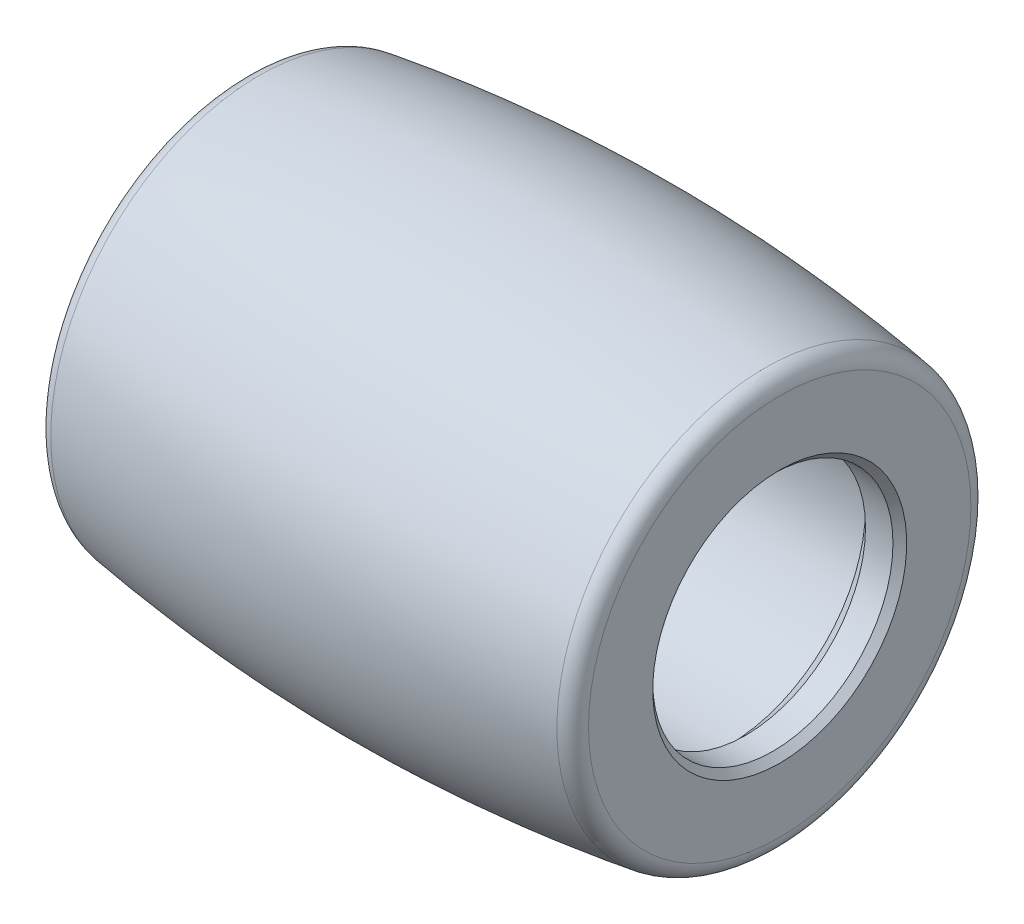
ISO-10303-21;
HEADER;
FILE_DESCRIPTION(('STEP AP214'),'2;1');
FILE_NAME('part.step','',(''),(''),'','','');
FILE_SCHEMA(('AUTOMOTIVE_DESIGN { 1 0 10303 214 1 1 1 1 }'));
ENDSEC;
DATA;
#1=APPLICATION_CONTEXT('core data for automotive mechanical design processes');
#2=APPLICATION_PROTOCOL_DEFINITION('international standard','automotive_design',2000,#1);
#3=PRODUCT_CONTEXT('',#1,'mechanical');
#4=PRODUCT('Part','Part','',(#3));
#5=PRODUCT_RELATED_PRODUCT_CATEGORY('part','',(#4));
#6=PRODUCT_DEFINITION_FORMATION('','',#4);
#7=PRODUCT_DEFINITION_CONTEXT('part definition',#1,'design');
#8=PRODUCT_DEFINITION('design','',#6,#7);
#9=PRODUCT_DEFINITION_SHAPE('','',#8);
#10=(LENGTH_UNIT() NAMED_UNIT(*) SI_UNIT(.MILLI.,.METRE.));
#11=(NAMED_UNIT(*) PLANE_ANGLE_UNIT() SI_UNIT($,.RADIAN.));
#12=(NAMED_UNIT(*) SI_UNIT($,.STERADIAN.) SOLID_ANGLE_UNIT());
#13=UNCERTAINTY_MEASURE_WITH_UNIT(LENGTH_MEASURE(1.E-05),#10,'distance_accuracy_value','');
#14=(GEOMETRIC_REPRESENTATION_CONTEXT(3) GLOBAL_UNCERTAINTY_ASSIGNED_CONTEXT((#13)) GLOBAL_UNIT_ASSIGNED_CONTEXT((#10,
#11,#12)) REPRESENTATION_CONTEXT('',''));
#15=CARTESIAN_POINT('',(0.,0.,0.));
#16=DIRECTION('',(0.,0.,1.));
#17=DIRECTION('',(1.,0.,0.));
#18=AXIS2_PLACEMENT_3D('',#15,#16,#17);
#19=CARTESIAN_POINT('',(-7.8,0.,0.));
#20=DIRECTION('',(-1.,0.,0.));
#21=DIRECTION('',(0.,0.,1.));
#22=AXIS2_PLACEMENT_3D('',#19,#20,#21);
#23=CYLINDRICAL_SURFACE('',#22,4.);
#24=CARTESIAN_POINT('',(-6.30000000012387,0.,0.));
#25=DIRECTION('',(1.,0.,0.));
#26=DIRECTION('',(0.,0.,-1.));
#27=AXIS2_PLACEMENT_3D('',#24,#25,#26);
#28=CIRCLE('',#27,3.99999999996226);
#29=CARTESIAN_POINT('',(-6.30000000012387,0.,-3.99999999996226));
#30=VERTEX_POINT('',#29);
#31=EDGE_CURVE('E55',#30,#30,#28,.F.);
#32=ORIENTED_EDGE('',*,*,#31,.T.);
#33=EDGE_LOOP('',(#32));
#34=FACE_BOUND('',#33,.T.);
#35=CARTESIAN_POINT('',(6.30000000012387,0.,0.));
#36=DIRECTION('',(-1.,0.,0.));
#37=DIRECTION('',(0.,0.,1.));
#38=AXIS2_PLACEMENT_3D('',#35,#36,#37);
#39=CIRCLE('',#38,3.99999999996226);
#40=CARTESIAN_POINT('',(6.30000000012387,0.,3.99999999996226));
#41=VERTEX_POINT('',#40);
#42=EDGE_CURVE('E78',#41,#41,#39,.F.);
#43=ORIENTED_EDGE('',*,*,#42,.T.);
#44=EDGE_LOOP('',(#43));
#45=FACE_BOUND('',#44,.T.);
#46=ADVANCED_FACE('F24',(#34,#45),#23,.F.);
#47=CARTESIAN_POINT('',(-6.30000000023756,0.,0.));
#48=DIRECTION('',(1.,0.,0.));
#49=DIRECTION('',(0.,0.,-1.));
#50=AXIS2_PLACEMENT_3D('',#47,#48,#49);
#51=CONICAL_SURFACE('',#50,3.99999999984857,0.785398163397448);
#52=CARTESIAN_POINT('',(-6.8,0.,0.));
#53=DIRECTION('',(1.,0.,0.));
#54=DIRECTION('',(0.,0.,-1.));
#55=AXIS2_PLACEMENT_3D('',#52,#53,#54);
#56=CIRCLE('',#55,3.5);
#57=CARTESIAN_POINT('',(-6.8,0.,-3.5));
#58=VERTEX_POINT('',#57);
#59=EDGE_CURVE('E76',#58,#58,#56,.F.);
#60=ORIENTED_EDGE('',*,*,#59,.T.);
#61=EDGE_LOOP('',(#60));
#62=FACE_BOUND('',#61,.T.);
#63=ORIENTED_EDGE('',*,*,#31,.F.);
#64=EDGE_LOOP('',(#63));
#65=FACE_BOUND('',#64,.T.);
#66=ADVANCED_FACE('F86',(#62,#65),#51,.F.);
#67=CARTESIAN_POINT('',(6.30000000023756,0.,0.));
#68=DIRECTION('',(-1.,0.,0.));
#69=DIRECTION('',(0.,0.,1.));
#70=AXIS2_PLACEMENT_3D('',#67,#68,#69);
#71=CONICAL_SURFACE('',#70,3.99999999984857,0.785398163397448);
#72=ORIENTED_EDGE('',*,*,#42,.F.);
#73=EDGE_LOOP('',(#72));
#74=FACE_BOUND('',#73,.T.);
#75=CARTESIAN_POINT('',(6.8,0.,0.));
#76=DIRECTION('',(1.,0.,0.));
#77=DIRECTION('',(0.,0.,-1.));
#78=AXIS2_PLACEMENT_3D('',#75,#76,#77);
#79=CIRCLE('',#78,3.5);
#80=CARTESIAN_POINT('',(6.8,0.,-3.5));
#81=VERTEX_POINT('',#80);
#82=EDGE_CURVE('E69',#81,#81,#79,.T.);
#83=ORIENTED_EDGE('',*,*,#82,.T.);
#84=EDGE_LOOP('',(#83));
#85=FACE_BOUND('',#84,.T.);
#86=ADVANCED_FACE('F88',(#74,#85),#71,.F.);
#87=CARTESIAN_POINT('',(-7.8,0.,0.));
#88=DIRECTION('',(1.,0.,0.));
#89=DIRECTION('',(0.,0.,-1.));
#90=AXIS2_PLACEMENT_3D('',#87,#88,#89);
#91=CYLINDRICAL_SURFACE('',#90,3.5);
#92=CARTESIAN_POINT('',(-7.60000000002492,0.,0.));
#93=DIRECTION('',(-1.,0.,0.));
#94=DIRECTION('',(0.,-1.,0.));
#95=AXIS2_PLACEMENT_3D('',#92,#93,#94);
#96=CIRCLE('',#95,3.49999999997408);
#97=CARTESIAN_POINT('',(-7.60000000002492,-3.49999999997408,0.));
#98=VERTEX_POINT('',#97);
#99=EDGE_CURVE('E64',#98,#98,#96,.T.);
#100=ORIENTED_EDGE('',*,*,#99,.T.);
#101=EDGE_LOOP('',(#100));
#102=FACE_BOUND('',#101,.T.);
#103=ORIENTED_EDGE('',*,*,#59,.F.);
#104=EDGE_LOOP('',(#103));
#105=FACE_BOUND('',#104,.T.);
#106=ADVANCED_FACE('F96',(#102,#105),#91,.F.);
#107=CARTESIAN_POINT('',(7.8,0.,0.));
#108=DIRECTION('',(1.,0.,0.));
#109=DIRECTION('',(0.,0.,-1.));
#110=AXIS2_PLACEMENT_3D('',#107,#108,#109);
#111=CYLINDRICAL_SURFACE('',#110,3.5);
#112=CARTESIAN_POINT('',(7.60000000008176,0.,0.));
#113=DIRECTION('',(1.,0.,0.));
#114=DIRECTION('',(0.,1.,0.));
#115=AXIS2_PLACEMENT_3D('',#112,#113,#114);
#116=CIRCLE('',#115,3.49999999997408);
#117=CARTESIAN_POINT('',(7.60000000008176,3.49999999997408,0.));
#118=VERTEX_POINT('',#117);
#119=EDGE_CURVE('E60',#118,#118,#116,.T.);
#120=ORIENTED_EDGE('',*,*,#119,.T.);
#121=EDGE_LOOP('',(#120));
#122=FACE_BOUND('',#121,.T.);
#123=ORIENTED_EDGE('',*,*,#82,.F.);
#124=EDGE_LOOP('',(#123));
#125=FACE_BOUND('',#124,.T.);
#126=ADVANCED_FACE('F126',(#122,#125),#111,.F.);
#127=CARTESIAN_POINT('',(-7.79999999997472,0.,0.));
#128=DIRECTION('',(-1.,0.,0.));
#129=DIRECTION('',(0.,0.,1.));
#130=AXIS2_PLACEMENT_3D('',#127,#128,#129);
#131=CONICAL_SURFACE('',#130,3.69999999992388,0.785398163397446);
#132=ORIENTED_EDGE('',*,*,#99,.F.);
#133=EDGE_LOOP('',(#132));
#134=FACE_BOUND('',#133,.T.);
#135=CARTESIAN_POINT('',(-7.79999999997472,0.,0.));
#136=DIRECTION('',(-1.,0.,0.));
#137=DIRECTION('',(0.,0.,1.));
#138=AXIS2_PLACEMENT_3D('',#135,#136,#137);
#139=CIRCLE('',#138,3.69999999992387);
#140=CARTESIAN_POINT('',(-7.79999999997472,0.,3.69999999992387));
#141=VERTEX_POINT('',#140);
#142=EDGE_CURVE('E28',#141,#141,#139,.T.);
#143=ORIENTED_EDGE('',*,*,#142,.T.);
#144=EDGE_LOOP('',(#143));
#145=FACE_BOUND('',#144,.T.);
#146=ADVANCED_FACE('F122',(#134,#145),#131,.F.);
#147=CARTESIAN_POINT('',(7.80000000003156,0.,0.));
#148=DIRECTION('',(1.,0.,0.));
#149=DIRECTION('',(0.,1.,0.));
#150=AXIS2_PLACEMENT_3D('',#147,#148,#149);
#151=CONICAL_SURFACE('',#150,3.69999999992388,0.78539816325534);
#152=ORIENTED_EDGE('',*,*,#119,.F.);
#153=EDGE_LOOP('',(#152));
#154=FACE_BOUND('',#153,.T.);
#155=CARTESIAN_POINT('',(7.80000000003156,0.,0.));
#156=DIRECTION('',(1.,0.,0.));
#157=DIRECTION('',(0.,1.,0.));
#158=AXIS2_PLACEMENT_3D('',#155,#156,#157);
#159=CIRCLE('',#158,3.69999999992388);
#160=CARTESIAN_POINT('',(7.80000000003156,3.69999999992388,0.));
#161=VERTEX_POINT('',#160);
#162=EDGE_CURVE('E45',#161,#161,#159,.F.);
#163=ORIENTED_EDGE('',*,*,#162,.F.);
#164=EDGE_LOOP('',(#163));
#165=FACE_BOUND('',#164,.T.);
#166=ADVANCED_FACE('F118',(#154,#165),#151,.F.);
#167=CARTESIAN_POINT('',(-7.8,0.,0.));
#168=DIRECTION('',(1.,0.,0.));
#169=DIRECTION('',(0.,0.,-1.));
#170=AXIS2_PLACEMENT_3D('',#167,#168,#169);
#171=PLANE('',#170);
#172=CARTESIAN_POINT('',(-7.79999999999784,-3.83374516150605E-13,2.18278986125421E-11));
#173=DIRECTION('',(1.,0.,0.));
#174=DIRECTION('',(0.,0.,-1.));
#175=AXIS2_PLACEMENT_3D('',#172,#173,#174);
#176=CIRCLE('',#175,5.57090392677671);
#177=CARTESIAN_POINT('',(-7.79999999999784,-3.83374516150605E-13,-5.57090392675488));
#178=VERTEX_POINT('',#177);
#179=EDGE_CURVE('E44',#178,#178,#176,.T.);
#180=ORIENTED_EDGE('',*,*,#179,.F.);
#181=EDGE_LOOP('',(#180));
#182=FACE_BOUND('',#181,.T.);
#183=ORIENTED_EDGE('',*,*,#142,.F.);
#184=EDGE_LOOP('',(#183));
#185=FACE_BOUND('',#184,.T.);
#186=ADVANCED_FACE('F115',(#182,#185),#171,.F.);
#187=CARTESIAN_POINT('',(7.8,0.,0.));
#188=DIRECTION('',(1.,0.,0.));
#189=DIRECTION('',(0.,0.,-1.));
#190=AXIS2_PLACEMENT_3D('',#187,#188,#189);
#191=PLANE('',#190);
#192=CARTESIAN_POINT('',(7.79999999999999,0.,-1.66946805772034E-12));
#193=DIRECTION('',(1.,0.,0.));
#194=DIRECTION('',(0.,0.,-1.));
#195=AXIS2_PLACEMENT_3D('',#192,#193,#194);
#196=CIRCLE('',#195,5.57090531712202);
#197=CARTESIAN_POINT('',(7.79999999999999,-5.570905317122,-2.90671959700568E-11));
#198=VERTEX_POINT('',#197);
#199=CARTESIAN_POINT('',(7.8,-5.57051079473146,-0.0662360651946447));
#200=VERTEX_POINT('',#199);
#201=EDGE_CURVE('E40',#198,#200,#196,.F.);
#202=ORIENTED_EDGE('',*,*,#201,.F.);
#203=DIRECTION('',(0.,0.00596807812759522,-0.999982190863149));
#204=VECTOR('',#203,1.);
#205=CARTESIAN_POINT('',(7.8,-5.570905317122,-2.90237152677025E-11));
#206=LINE('',#205,#204);
#207=EDGE_CURVE('E42',#198,#200,#206,.T.);
#208=ORIENTED_EDGE('',*,*,#207,.T.);
#209=EDGE_LOOP('',(#202,#208));
#210=FACE_BOUND('',#209,.T.);
#211=ORIENTED_EDGE('',*,*,#162,.T.);
#212=EDGE_LOOP('',(#211));
#213=FACE_BOUND('',#212,.T.);
#214=ADVANCED_FACE('F47',(#210,#213),#191,.T.);
#215=CARTESIAN_POINT('',(-7.29999999999999,-3.83373888190874E-13,2.18278628678903E-11));
#216=DIRECTION('',(1.,0.,0.));
#217=DIRECTION('',(0.,0.,-1.));
#218=AXIS2_PLACEMENT_3D('',#215,#216,#217);
#219=TOROIDAL_SURFACE('',#218,5.57090539665,0.500000000000005);
#220=CARTESIAN_POINT('',(-7.37373740775296,0.,-1.35308431126191E-13));
#221=DIRECTION('',(1.,0.,0.));
#222=DIRECTION('',(0.,0.,-1.));
#223=AXIS2_PLACEMENT_3D('',#220,#221,#222);
#224=CIRCLE('',#223,6.06543830222605);
#225=CARTESIAN_POINT('',(-7.37373740775296,0.,-6.06543830222618));
#226=VERTEX_POINT('',#225);
#227=EDGE_CURVE('E33',#226,#226,#224,.T.);
#228=ORIENTED_EDGE('',*,*,#227,.F.);
#229=EDGE_LOOP('',(#228));
#230=FACE_BOUND('',#229,.T.);
#231=ORIENTED_EDGE('',*,*,#179,.T.);
#232=EDGE_LOOP('',(#231));
#233=FACE_BOUND('',#232,.T.);
#234=ADVANCED_FACE('F107',(#230,#233),#219,.T.);
#235=CARTESIAN_POINT('',(7.3,0.,-1.66946805772034E-12));
#236=DIRECTION('',(1.,0.,0.));
#237=DIRECTION('',(0.,0.,-1.));
#238=AXIS2_PLACEMENT_3D('',#235,#236,#237);
#239=TOROIDAL_SURFACE('',#238,5.57090539665,0.500000000000003);
#240=CARTESIAN_POINT('',(7.37373739217235,0.,-1.35308431126191E-13));
#241=DIRECTION('',(1.,0.,0.));
#242=DIRECTION('',(0.,0.,-1.));
#243=AXIS2_PLACEMENT_3D('',#240,#241,#242);
#244=CIRCLE('',#243,6.06543830454967);
#245=CARTESIAN_POINT('',(7.37373739217235,0.,-6.0654383045498));
#246=VERTEX_POINT('',#245);
#247=EDGE_CURVE('E13',#246,#246,#244,.F.);
#248=ORIENTED_EDGE('',*,*,#247,.F.);
#249=EDGE_LOOP('',(#248));
#250=FACE_BOUND('',#249,.T.);
#251=ORIENTED_EDGE('',*,*,#201,.T.);
#252=ORIENTED_EDGE('',*,*,#207,.F.);
#253=EDGE_LOOP('',(#251,#252));
#254=FACE_BOUND('',#253,.T.);
#255=ADVANCED_FACE('F26',(#250,#254),#239,.T.);
#256=CARTESIAN_POINT('',(1.57903204400789E-12,0.,43.3878527575467));
#257=DIRECTION('',(0.,1.,0.));
#258=DIRECTION('',(0.,0.,-1.));
#259=AXIS2_PLACEMENT_3D('',#256,#257,#258);
#260=CIRCLE('',#259,50.0000000000113);
#261=TRIMMED_CURVE('',#260,(PARAMETER_VALUE(-0.520125015553683)),
(PARAMETER_VALUE(0.520125015553683)),.T.,.PARAMETER.);
#262=CARTESIAN_POINT('',(1.57903204400789E-12,0.,-1.35308431126191E-13));
#263=DIRECTION('',(1.,0.,0.));
#264=AXIS1_PLACEMENT('',#262,#263);
#265=SURFACE_OF_REVOLUTION('',#261,#264);
#266=ORIENTED_EDGE('',*,*,#227,.T.);
#267=EDGE_LOOP('',(#266));
#268=FACE_BOUND('',#267,.T.);
#269=ORIENTED_EDGE('',*,*,#247,.T.);
#270=EDGE_LOOP('',(#269));
#271=FACE_BOUND('',#270,.T.);
#272=ADVANCED_FACE('F100',(#268,#271),#265,.F.);
#273=CLOSED_SHELL('',(#46,#66,#86,#106,#126,#146,#166,#186,#214,#234,#255,#272));
#274=MANIFOLD_SOLID_BREP('B1',#273);
#275=ADVANCED_BREP_SHAPE_REPRESENTATION('',(#18,#274),#14);
#276=SHAPE_DEFINITION_REPRESENTATION(#9,#275);
ENDSEC;
END-ISO-10303-21;
